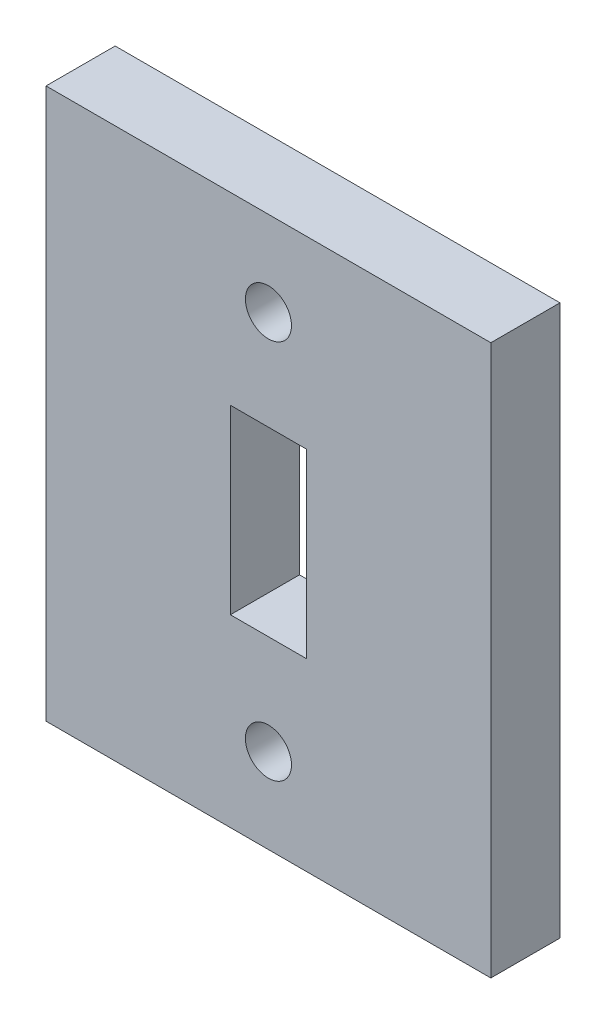
ISO-10303-21;
HEADER;
FILE_DESCRIPTION(('STEP AP214'),'2;1');
FILE_NAME('part.step','',(''),(''),'','','');
FILE_SCHEMA(('AUTOMOTIVE_DESIGN { 1 0 10303 214 1 1 1 1 }'));
ENDSEC;
DATA;
#1=APPLICATION_CONTEXT('core data for automotive mechanical design processes');
#2=APPLICATION_PROTOCOL_DEFINITION('international standard','automotive_design',2000,#1);
#3=PRODUCT_CONTEXT('',#1,'mechanical');
#4=PRODUCT('Part','Part','',(#3));
#5=PRODUCT_RELATED_PRODUCT_CATEGORY('part','',(#4));
#6=PRODUCT_DEFINITION_FORMATION('','',#4);
#7=PRODUCT_DEFINITION_CONTEXT('part definition',#1,'design');
#8=PRODUCT_DEFINITION('design','',#6,#7);
#9=PRODUCT_DEFINITION_SHAPE('','',#8);
#10=(LENGTH_UNIT() NAMED_UNIT(*) SI_UNIT(.MILLI.,.METRE.));
#11=(NAMED_UNIT(*) PLANE_ANGLE_UNIT() SI_UNIT($,.RADIAN.));
#12=(NAMED_UNIT(*) SI_UNIT($,.STERADIAN.) SOLID_ANGLE_UNIT());
#13=UNCERTAINTY_MEASURE_WITH_UNIT(LENGTH_MEASURE(1.E-05),#10,'distance_accuracy_value','');
#14=(GEOMETRIC_REPRESENTATION_CONTEXT(3) GLOBAL_UNCERTAINTY_ASSIGNED_CONTEXT((#13)) GLOBAL_UNIT_ASSIGNED_CONTEXT((#10,
#11,#12)) REPRESENTATION_CONTEXT('',''));
#15=CARTESIAN_POINT('',(0.,0.,0.));
#16=DIRECTION('',(0.,0.,1.));
#17=DIRECTION('',(1.,0.,0.));
#18=AXIS2_PLACEMENT_3D('',#15,#16,#17);
#19=CARTESIAN_POINT('',(0.,0.,3.));
#20=DIRECTION('',(0.,0.,1.));
#21=DIRECTION('',(1.,0.,0.));
#22=AXIS2_PLACEMENT_3D('',#19,#20,#21);
#23=PLANE('',#22);
#24=CARTESIAN_POINT('',(9.65099999999999,3.682,3.));
#25=DIRECTION('',(0.,0.,-1.));
#26=DIRECTION('',(1.,0.,0.));
#27=AXIS2_PLACEMENT_3D('',#24,#25,#26);
#28=CIRCLE('',#27,1.);
#29=CARTESIAN_POINT('',(10.651,3.682,3.));
#30=VERTEX_POINT('',#29);
#31=EDGE_CURVE('E228',#30,#30,#28,.T.);
#32=ORIENTED_EDGE('',*,*,#31,.T.);
#33=EDGE_LOOP('',(#32));
#34=FACE_BOUND('',#33,.T.);
#35=CARTESIAN_POINT('',(9.651,20.192,3.));
#36=DIRECTION('',(0.,0.,-1.));
#37=DIRECTION('',(-1.,0.,0.));
#38=AXIS2_PLACEMENT_3D('',#35,#36,#37);
#39=CIRCLE('',#38,1.);
#40=CARTESIAN_POINT('',(8.651,20.192,3.));
#41=VERTEX_POINT('',#40);
#42=EDGE_CURVE('E127',#41,#41,#39,.T.);
#43=ORIENTED_EDGE('',*,*,#42,.T.);
#44=EDGE_LOOP('',(#43));
#45=FACE_BOUND('',#44,.T.);
#46=DIRECTION('',(0.,-1.,0.));
#47=VECTOR('',#46,1.);
#48=CARTESIAN_POINT('',(0.,23.874,3.));
#49=LINE('',#48,#47);
#50=CARTESIAN_POINT('',(0.,23.874,3.));
#51=VERTEX_POINT('',#50);
#52=CARTESIAN_POINT('',(0.,0.,3.));
#53=VERTEX_POINT('',#52);
#54=EDGE_CURVE('E137',#51,#53,#49,.T.);
#55=ORIENTED_EDGE('',*,*,#54,.T.);
#56=DIRECTION('',(1.,0.,0.));
#57=VECTOR('',#56,1.);
#58=CARTESIAN_POINT('',(0.,0.,3.));
#59=LINE('',#58,#57);
#60=CARTESIAN_POINT('',(19.302,0.,3.));
#61=VERTEX_POINT('',#60);
#62=EDGE_CURVE('E140',#53,#61,#59,.T.);
#63=ORIENTED_EDGE('',*,*,#62,.T.);
#64=DIRECTION('',(0.,1.,0.));
#65=VECTOR('',#64,1.);
#66=CARTESIAN_POINT('',(19.302,23.874,3.));
#67=LINE('',#66,#65);
#68=CARTESIAN_POINT('',(19.302,23.874,3.));
#69=VERTEX_POINT('',#68);
#70=EDGE_CURVE('E143',#61,#69,#67,.T.);
#71=ORIENTED_EDGE('',*,*,#70,.T.);
#72=DIRECTION('',(-1.,0.,0.));
#73=VECTOR('',#72,1.);
#74=CARTESIAN_POINT('',(0.,23.874,3.));
#75=LINE('',#74,#73);
#76=EDGE_CURVE('E145',#69,#51,#75,.T.);
#77=ORIENTED_EDGE('',*,*,#76,.T.);
#78=EDGE_LOOP('',(#55,#63,#71,#77));
#79=FACE_BOUND('',#78,.T.);
#80=DIRECTION('',(1.,0.,0.));
#81=VECTOR('',#80,1.);
#82=CARTESIAN_POINT('',(8.,8.,3.));
#83=LINE('',#82,#81);
#84=CARTESIAN_POINT('',(8.,8.,3.));
#85=VERTEX_POINT('',#84);
#86=CARTESIAN_POINT('',(11.302,8.,3.));
#87=VERTEX_POINT('',#86);
#88=EDGE_CURVE('E107',#85,#87,#83,.T.);
#89=ORIENTED_EDGE('',*,*,#88,.F.);
#90=DIRECTION('',(0.,-1.,0.));
#91=VECTOR('',#90,1.);
#92=CARTESIAN_POINT('',(8.,15.874,3.));
#93=LINE('',#92,#91);
#94=CARTESIAN_POINT('',(8.,15.874,3.));
#95=VERTEX_POINT('',#94);
#96=EDGE_CURVE('E99',#95,#85,#93,.T.);
#97=ORIENTED_EDGE('',*,*,#96,.F.);
#98=DIRECTION('',(-1.,0.,0.));
#99=VECTOR('',#98,1.);
#100=CARTESIAN_POINT('',(8.,15.874,3.));
#101=LINE('',#100,#99);
#102=CARTESIAN_POINT('',(11.302,15.874,3.));
#103=VERTEX_POINT('',#102);
#104=EDGE_CURVE('E121',#103,#95,#101,.T.);
#105=ORIENTED_EDGE('',*,*,#104,.F.);
#106=DIRECTION('',(0.,1.,0.));
#107=VECTOR('',#106,1.);
#108=CARTESIAN_POINT('',(11.302,15.874,3.));
#109=LINE('',#108,#107);
#110=EDGE_CURVE('E119',#87,#103,#109,.T.);
#111=ORIENTED_EDGE('',*,*,#110,.F.);
#112=EDGE_LOOP('',(#89,#97,#105,#111));
#113=FACE_BOUND('',#112,.T.);
#114=ADVANCED_FACE('F34',(#34,#45,#79,#113),#23,.T.);
#115=CARTESIAN_POINT('',(0.,0.,0.));
#116=DIRECTION('',(0.,0.,1.));
#117=DIRECTION('',(1.,0.,0.));
#118=AXIS2_PLACEMENT_3D('',#115,#116,#117);
#119=PLANE('',#118);
#120=CARTESIAN_POINT('',(9.65099999999999,3.682,0.));
#121=DIRECTION('',(0.,0.,-1.));
#122=DIRECTION('',(1.,0.,0.));
#123=AXIS2_PLACEMENT_3D('',#120,#121,#122);
#124=CIRCLE('',#123,1.);
#125=CARTESIAN_POINT('',(10.651,3.682,0.));
#126=VERTEX_POINT('',#125);
#127=EDGE_CURVE('E231',#126,#126,#124,.T.);
#128=ORIENTED_EDGE('',*,*,#127,.F.);
#129=EDGE_LOOP('',(#128));
#130=FACE_BOUND('',#129,.T.);
#131=CARTESIAN_POINT('',(9.651,20.192,0.));
#132=DIRECTION('',(0.,0.,-1.));
#133=DIRECTION('',(-1.,0.,0.));
#134=AXIS2_PLACEMENT_3D('',#131,#132,#133);
#135=CIRCLE('',#134,1.);
#136=CARTESIAN_POINT('',(8.651,20.192,0.));
#137=VERTEX_POINT('',#136);
#138=EDGE_CURVE('E233',#137,#137,#135,.T.);
#139=ORIENTED_EDGE('',*,*,#138,.F.);
#140=EDGE_LOOP('',(#139));
#141=FACE_BOUND('',#140,.T.);
#142=DIRECTION('',(0.,-1.,0.));
#143=VECTOR('',#142,1.);
#144=CARTESIAN_POINT('',(0.,23.874,0.));
#145=LINE('',#144,#143);
#146=CARTESIAN_POINT('',(0.,23.874,0.));
#147=VERTEX_POINT('',#146);
#148=CARTESIAN_POINT('',(0.,0.,0.));
#149=VERTEX_POINT('',#148);
#150=EDGE_CURVE('E115',#147,#149,#145,.T.);
#151=ORIENTED_EDGE('',*,*,#150,.F.);
#152=DIRECTION('',(-1.,0.,0.));
#153=VECTOR('',#152,1.);
#154=CARTESIAN_POINT('',(0.,23.874,0.));
#155=LINE('',#154,#153);
#156=CARTESIAN_POINT('',(19.302,23.874,0.));
#157=VERTEX_POINT('',#156);
#158=EDGE_CURVE('E141',#157,#147,#155,.T.);
#159=ORIENTED_EDGE('',*,*,#158,.F.);
#160=DIRECTION('',(0.,1.,0.));
#161=VECTOR('',#160,1.);
#162=CARTESIAN_POINT('',(19.302,23.874,0.));
#163=LINE('',#162,#161);
#164=CARTESIAN_POINT('',(19.302,0.,0.));
#165=VERTEX_POINT('',#164);
#166=EDGE_CURVE('E152',#165,#157,#163,.T.);
#167=ORIENTED_EDGE('',*,*,#166,.F.);
#168=DIRECTION('',(1.,0.,0.));
#169=VECTOR('',#168,1.);
#170=CARTESIAN_POINT('',(0.,0.,0.));
#171=LINE('',#170,#169);
#172=EDGE_CURVE('E150',#149,#165,#171,.T.);
#173=ORIENTED_EDGE('',*,*,#172,.F.);
#174=EDGE_LOOP('',(#151,#159,#167,#173));
#175=FACE_BOUND('',#174,.T.);
#176=DIRECTION('',(0.,-1.,0.));
#177=VECTOR('',#176,1.);
#178=CARTESIAN_POINT('',(8.,15.874,0.));
#179=LINE('',#178,#177);
#180=CARTESIAN_POINT('',(8.,15.874,0.));
#181=VERTEX_POINT('',#180);
#182=CARTESIAN_POINT('',(8.,8.,0.));
#183=VERTEX_POINT('',#182);
#184=EDGE_CURVE('E57',#181,#183,#179,.T.);
#185=ORIENTED_EDGE('',*,*,#184,.T.);
#186=DIRECTION('',(1.,0.,0.));
#187=VECTOR('',#186,1.);
#188=CARTESIAN_POINT('',(8.,8.,0.));
#189=LINE('',#188,#187);
#190=CARTESIAN_POINT('',(11.302,8.,0.));
#191=VERTEX_POINT('',#190);
#192=EDGE_CURVE('E114',#183,#191,#189,.T.);
#193=ORIENTED_EDGE('',*,*,#192,.T.);
#194=DIRECTION('',(0.,1.,0.));
#195=VECTOR('',#194,1.);
#196=CARTESIAN_POINT('',(11.302,15.874,0.));
#197=LINE('',#196,#195);
#198=CARTESIAN_POINT('',(11.302,15.874,0.));
#199=VERTEX_POINT('',#198);
#200=EDGE_CURVE('E129',#191,#199,#197,.T.);
#201=ORIENTED_EDGE('',*,*,#200,.T.);
#202=DIRECTION('',(-1.,0.,0.));
#203=VECTOR('',#202,1.);
#204=CARTESIAN_POINT('',(8.,15.874,0.));
#205=LINE('',#204,#203);
#206=EDGE_CURVE('E108',#199,#181,#205,.T.);
#207=ORIENTED_EDGE('',*,*,#206,.T.);
#208=EDGE_LOOP('',(#185,#193,#201,#207));
#209=FACE_BOUND('',#208,.T.);
#210=ADVANCED_FACE('F170',(#130,#141,#175,#209),#119,.F.);
#211=CARTESIAN_POINT('',(0.,23.874,3.));
#212=DIRECTION('',(1.,0.,0.));
#213=DIRECTION('',(0.,1.,0.));
#214=AXIS2_PLACEMENT_3D('',#211,#212,#213);
#215=PLANE('',#214);
#216=ORIENTED_EDGE('',*,*,#150,.T.);
#217=DIRECTION('',(0.,0.,-1.));
#218=VECTOR('',#217,1.);
#219=CARTESIAN_POINT('',(0.,0.,3.));
#220=LINE('',#219,#218);
#221=EDGE_CURVE('E11',#53,#149,#220,.T.);
#222=ORIENTED_EDGE('',*,*,#221,.F.);
#223=ORIENTED_EDGE('',*,*,#54,.F.);
#224=DIRECTION('',(0.,0.,-1.));
#225=VECTOR('',#224,1.);
#226=CARTESIAN_POINT('',(0.,23.874,3.));
#227=LINE('',#226,#225);
#228=EDGE_CURVE('E147',#51,#147,#227,.T.);
#229=ORIENTED_EDGE('',*,*,#228,.T.);
#230=EDGE_LOOP('',(#216,#222,#223,#229));
#231=FACE_BOUND('',#230,.T.);
#232=ADVANCED_FACE('F36',(#231),#215,.F.);
#233=CARTESIAN_POINT('',(0.,0.,3.));
#234=DIRECTION('',(0.,1.,0.));
#235=DIRECTION('',(0.,0.,1.));
#236=AXIS2_PLACEMENT_3D('',#233,#234,#235);
#237=PLANE('',#236);
#238=ORIENTED_EDGE('',*,*,#172,.T.);
#239=DIRECTION('',(0.,0.,-1.));
#240=VECTOR('',#239,1.);
#241=CARTESIAN_POINT('',(19.302,0.,3.));
#242=LINE('',#241,#240);
#243=EDGE_CURVE('E42',#61,#165,#242,.T.);
#244=ORIENTED_EDGE('',*,*,#243,.F.);
#245=ORIENTED_EDGE('',*,*,#62,.F.);
#246=ORIENTED_EDGE('',*,*,#221,.T.);
#247=EDGE_LOOP('',(#238,#244,#245,#246));
#248=FACE_BOUND('',#247,.T.);
#249=ADVANCED_FACE('F180',(#248),#237,.F.);
#250=CARTESIAN_POINT('',(19.302,23.874,3.));
#251=DIRECTION('',(-1.,0.,0.));
#252=DIRECTION('',(0.,-1.,0.));
#253=AXIS2_PLACEMENT_3D('',#250,#251,#252);
#254=PLANE('',#253);
#255=ORIENTED_EDGE('',*,*,#166,.T.);
#256=DIRECTION('',(0.,0.,-1.));
#257=VECTOR('',#256,1.);
#258=CARTESIAN_POINT('',(19.302,23.874,3.));
#259=LINE('',#258,#257);
#260=EDGE_CURVE('E157',#69,#157,#259,.T.);
#261=ORIENTED_EDGE('',*,*,#260,.F.);
#262=ORIENTED_EDGE('',*,*,#70,.F.);
#263=ORIENTED_EDGE('',*,*,#243,.T.);
#264=EDGE_LOOP('',(#255,#261,#262,#263));
#265=FACE_BOUND('',#264,.T.);
#266=ADVANCED_FACE('F164',(#265),#254,.F.);
#267=CARTESIAN_POINT('',(0.,23.874,3.));
#268=DIRECTION('',(0.,-1.,0.));
#269=DIRECTION('',(0.,0.,-1.));
#270=AXIS2_PLACEMENT_3D('',#267,#268,#269);
#271=PLANE('',#270);
#272=ORIENTED_EDGE('',*,*,#158,.T.);
#273=ORIENTED_EDGE('',*,*,#228,.F.);
#274=ORIENTED_EDGE('',*,*,#76,.F.);
#275=ORIENTED_EDGE('',*,*,#260,.T.);
#276=EDGE_LOOP('',(#272,#273,#274,#275));
#277=FACE_BOUND('',#276,.T.);
#278=ADVANCED_FACE('F174',(#277),#271,.F.);
#279=CARTESIAN_POINT('',(8.,15.874,3.));
#280=DIRECTION('',(1.,0.,0.));
#281=DIRECTION('',(0.,1.,0.));
#282=AXIS2_PLACEMENT_3D('',#279,#280,#281);
#283=PLANE('',#282);
#284=ORIENTED_EDGE('',*,*,#184,.F.);
#285=DIRECTION('',(0.,0.,-1.));
#286=VECTOR('',#285,1.);
#287=CARTESIAN_POINT('',(8.,15.874,3.));
#288=LINE('',#287,#286);
#289=EDGE_CURVE('E103',#95,#181,#288,.T.);
#290=ORIENTED_EDGE('',*,*,#289,.F.);
#291=ORIENTED_EDGE('',*,*,#96,.T.);
#292=DIRECTION('',(0.,0.,-1.));
#293=VECTOR('',#292,1.);
#294=CARTESIAN_POINT('',(8.,8.,3.));
#295=LINE('',#294,#293);
#296=EDGE_CURVE('E102',#85,#183,#295,.T.);
#297=ORIENTED_EDGE('',*,*,#296,.T.);
#298=EDGE_LOOP('',(#284,#290,#291,#297));
#299=FACE_BOUND('',#298,.T.);
#300=ADVANCED_FACE('F101',(#299),#283,.T.);
#301=CARTESIAN_POINT('',(8.,8.,3.));
#302=DIRECTION('',(0.,1.,0.));
#303=DIRECTION('',(0.,0.,1.));
#304=AXIS2_PLACEMENT_3D('',#301,#302,#303);
#305=PLANE('',#304);
#306=ORIENTED_EDGE('',*,*,#192,.F.);
#307=ORIENTED_EDGE('',*,*,#296,.F.);
#308=ORIENTED_EDGE('',*,*,#88,.T.);
#309=DIRECTION('',(0.,0.,-1.));
#310=VECTOR('',#309,1.);
#311=CARTESIAN_POINT('',(11.302,8.,3.));
#312=LINE('',#311,#310);
#313=EDGE_CURVE('E116',#87,#191,#312,.T.);
#314=ORIENTED_EDGE('',*,*,#313,.T.);
#315=EDGE_LOOP('',(#306,#307,#308,#314));
#316=FACE_BOUND('',#315,.T.);
#317=ADVANCED_FACE('F111',(#316),#305,.T.);
#318=CARTESIAN_POINT('',(11.302,15.874,3.));
#319=DIRECTION('',(-1.,0.,0.));
#320=DIRECTION('',(0.,-1.,0.));
#321=AXIS2_PLACEMENT_3D('',#318,#319,#320);
#322=PLANE('',#321);
#323=ORIENTED_EDGE('',*,*,#200,.F.);
#324=ORIENTED_EDGE('',*,*,#313,.F.);
#325=ORIENTED_EDGE('',*,*,#110,.T.);
#326=DIRECTION('',(0.,0.,-1.));
#327=VECTOR('',#326,1.);
#328=CARTESIAN_POINT('',(11.302,15.874,3.));
#329=LINE('',#328,#327);
#330=EDGE_CURVE('E49',#103,#199,#329,.T.);
#331=ORIENTED_EDGE('',*,*,#330,.T.);
#332=EDGE_LOOP('',(#323,#324,#325,#331));
#333=FACE_BOUND('',#332,.T.);
#334=ADVANCED_FACE('F207',(#333),#322,.T.);
#335=CARTESIAN_POINT('',(8.,15.874,3.));
#336=DIRECTION('',(0.,-1.,0.));
#337=DIRECTION('',(0.,0.,-1.));
#338=AXIS2_PLACEMENT_3D('',#335,#336,#337);
#339=PLANE('',#338);
#340=ORIENTED_EDGE('',*,*,#206,.F.);
#341=ORIENTED_EDGE('',*,*,#330,.F.);
#342=ORIENTED_EDGE('',*,*,#104,.T.);
#343=ORIENTED_EDGE('',*,*,#289,.T.);
#344=EDGE_LOOP('',(#340,#341,#342,#343));
#345=FACE_BOUND('',#344,.T.);
#346=ADVANCED_FACE('F211',(#345),#339,.T.);
#347=CARTESIAN_POINT('',(9.651,20.192,3.));
#348=DIRECTION('',(0.,0.,-1.));
#349=DIRECTION('',(-1.,0.,0.));
#350=AXIS2_PLACEMENT_3D('',#347,#348,#349);
#351=CYLINDRICAL_SURFACE('',#350,1.);
#352=ORIENTED_EDGE('',*,*,#42,.F.);
#353=EDGE_LOOP('',(#352));
#354=FACE_BOUND('',#353,.T.);
#355=ORIENTED_EDGE('',*,*,#138,.T.);
#356=EDGE_LOOP('',(#355));
#357=FACE_BOUND('',#356,.T.);
#358=ADVANCED_FACE('F217',(#354,#357),#351,.F.);
#359=CARTESIAN_POINT('',(9.65099999999999,3.682,3.));
#360=DIRECTION('',(0.,0.,-1.));
#361=DIRECTION('',(-1.,0.,0.));
#362=AXIS2_PLACEMENT_3D('',#359,#360,#361);
#363=CYLINDRICAL_SURFACE('',#362,1.);
#364=ORIENTED_EDGE('',*,*,#31,.F.);
#365=EDGE_LOOP('',(#364));
#366=FACE_BOUND('',#365,.T.);
#367=ORIENTED_EDGE('',*,*,#127,.T.);
#368=EDGE_LOOP('',(#367));
#369=FACE_BOUND('',#368,.T.);
#370=ADVANCED_FACE('F220',(#366,#369),#363,.F.);
#371=CLOSED_SHELL('',(#114,#210,#232,#249,#266,#278,#300,#317,#334,#346,#358,#370));
#372=MANIFOLD_SOLID_BREP('B2',#371);
#373=ADVANCED_BREP_SHAPE_REPRESENTATION('',(#18,#372),#14);
#374=SHAPE_DEFINITION_REPRESENTATION(#9,#373);
ENDSEC;
END-ISO-10303-21;
